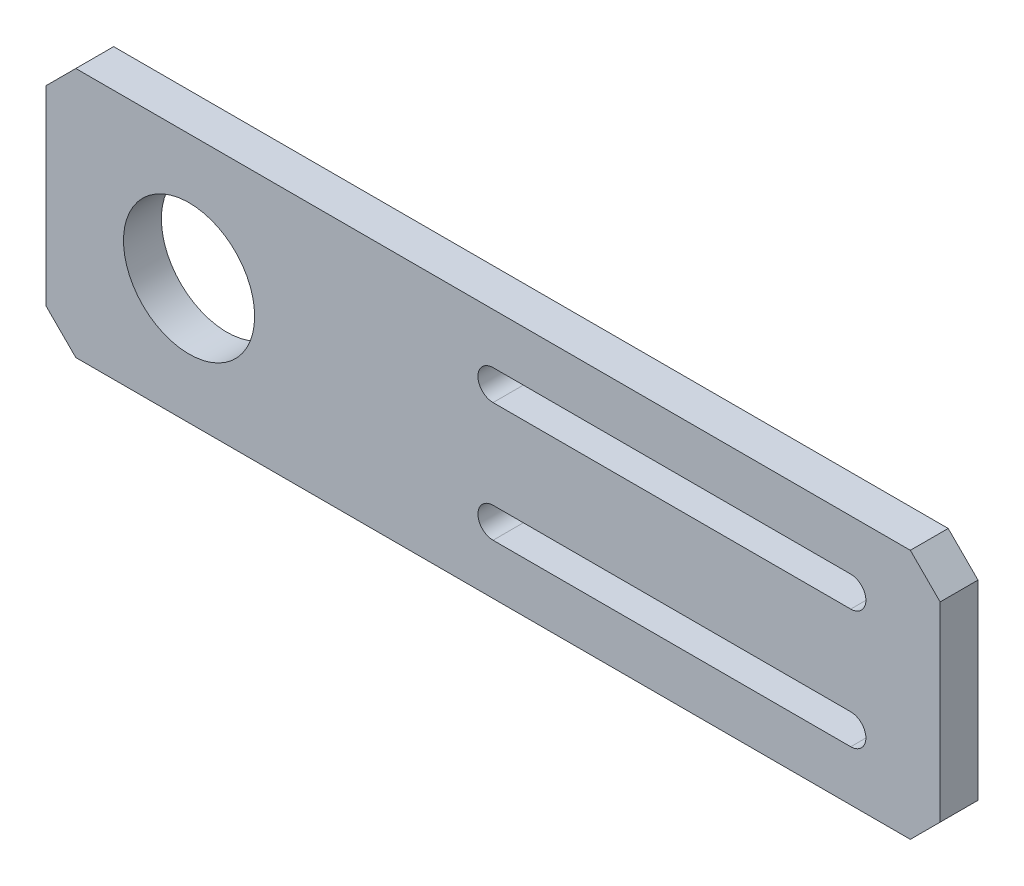
ISO-10303-21;
HEADER;
FILE_DESCRIPTION(('STEP AP214'),'2;1');
FILE_NAME('part.step','',(''),(''),'','','');
FILE_SCHEMA(('AUTOMOTIVE_DESIGN { 1 0 10303 214 1 1 1 1 }'));
ENDSEC;
DATA;
#1=APPLICATION_CONTEXT('core data for automotive mechanical design processes');
#2=APPLICATION_PROTOCOL_DEFINITION('international standard','automotive_design',2000,#1);
#3=PRODUCT_CONTEXT('',#1,'mechanical');
#4=PRODUCT('Part','Part','',(#3));
#5=PRODUCT_RELATED_PRODUCT_CATEGORY('part','',(#4));
#6=PRODUCT_DEFINITION_FORMATION('','',#4);
#7=PRODUCT_DEFINITION_CONTEXT('part definition',#1,'design');
#8=PRODUCT_DEFINITION('design','',#6,#7);
#9=PRODUCT_DEFINITION_SHAPE('','',#8);
#10=(LENGTH_UNIT() NAMED_UNIT(*) SI_UNIT(.MILLI.,.METRE.));
#11=(NAMED_UNIT(*) PLANE_ANGLE_UNIT() SI_UNIT($,.RADIAN.));
#12=(NAMED_UNIT(*) SI_UNIT($,.STERADIAN.) SOLID_ANGLE_UNIT());
#13=UNCERTAINTY_MEASURE_WITH_UNIT(LENGTH_MEASURE(1.E-05),#10,'distance_accuracy_value','');
#14=(GEOMETRIC_REPRESENTATION_CONTEXT(3) GLOBAL_UNCERTAINTY_ASSIGNED_CONTEXT((#13)) GLOBAL_UNIT_ASSIGNED_CONTEXT((#10,
#11,#12)) REPRESENTATION_CONTEXT('',''));
#15=CARTESIAN_POINT('',(0.,0.,0.));
#16=DIRECTION('',(0.,0.,1.));
#17=DIRECTION('',(1.,0.,0.));
#18=AXIS2_PLACEMENT_3D('',#15,#16,#17);
#19=CARTESIAN_POINT('',(0.,0.,6.35));
#20=DIRECTION('',(0.,0.,1.));
#21=DIRECTION('',(1.,0.,0.));
#22=AXIS2_PLACEMENT_3D('',#19,#20,#21);
#23=PLANE('',#22);
#24=DIRECTION('',(0.707106781186547,-0.707106781186548,0.));
#25=VECTOR('',#24,1.);
#26=CARTESIAN_POINT('',(31.75,31.75,6.35));
#27=LINE('',#26,#25);
#28=CARTESIAN_POINT('',(42.5,21.,6.35));
#29=VERTEX_POINT('',#28);
#30=CARTESIAN_POINT('',(47.5,16.,6.35));
#31=VERTEX_POINT('',#30);
#32=EDGE_CURVE('E158',#29,#31,#27,.T.);
#33=ORIENTED_EDGE('',*,*,#32,.F.);
#34=DIRECTION('',(-1.,0.,0.));
#35=VECTOR('',#34,1.);
#36=CARTESIAN_POINT('',(-102.5,21.,6.35));
#37=LINE('',#36,#35);
#38=CARTESIAN_POINT('',(-97.5,21.,6.35));
#39=VERTEX_POINT('',#38);
#40=EDGE_CURVE('E223',#29,#39,#37,.T.);
#41=ORIENTED_EDGE('',*,*,#40,.T.);
#42=DIRECTION('',(0.707106781186548,0.707106781186548,0.));
#43=VECTOR('',#42,1.);
#44=CARTESIAN_POINT('',(-59.25,59.25,6.35));
#45=LINE('',#44,#43);
#46=CARTESIAN_POINT('',(-102.5,16.,6.35));
#47=VERTEX_POINT('',#46);
#48=EDGE_CURVE('E251',#39,#47,#45,.F.);
#49=ORIENTED_EDGE('',*,*,#48,.T.);
#50=DIRECTION('',(0.,-1.,0.));
#51=VECTOR('',#50,1.);
#52=CARTESIAN_POINT('',(-102.5,21.,6.35));
#53=LINE('',#52,#51);
#54=CARTESIAN_POINT('',(-102.5,-16.,6.35));
#55=VERTEX_POINT('',#54);
#56=EDGE_CURVE('E225',#47,#55,#53,.T.);
#57=ORIENTED_EDGE('',*,*,#56,.T.);
#58=DIRECTION('',(-0.707106781186548,0.707106781186548,0.));
#59=VECTOR('',#58,1.);
#60=CARTESIAN_POINT('',(-59.25,-59.25,6.35));
#61=LINE('',#60,#59);
#62=CARTESIAN_POINT('',(-97.5,-21.,6.35));
#63=VERTEX_POINT('',#62);
#64=EDGE_CURVE('E249',#55,#63,#61,.F.);
#65=ORIENTED_EDGE('',*,*,#64,.T.);
#66=DIRECTION('',(1.,0.,0.));
#67=VECTOR('',#66,1.);
#68=CARTESIAN_POINT('',(-102.5,-21.,6.35));
#69=LINE('',#68,#67);
#70=CARTESIAN_POINT('',(42.5,-21.,6.35));
#71=VERTEX_POINT('',#70);
#72=EDGE_CURVE('E173',#63,#71,#69,.T.);
#73=ORIENTED_EDGE('',*,*,#72,.T.);
#74=DIRECTION('',(-0.707106781186547,-0.707106781186548,0.));
#75=VECTOR('',#74,1.);
#76=CARTESIAN_POINT('',(31.75,-31.75,6.35));
#77=LINE('',#76,#75);
#78=CARTESIAN_POINT('',(47.5,-16.,6.35));
#79=VERTEX_POINT('',#78);
#80=EDGE_CURVE('E151',#79,#71,#77,.T.);
#81=ORIENTED_EDGE('',*,*,#80,.F.);
#82=DIRECTION('',(0.,-1.,0.));
#83=VECTOR('',#82,1.);
#84=CARTESIAN_POINT('',(47.5,0.,6.35));
#85=LINE('',#84,#83);
#86=EDGE_CURVE('E161',#31,#79,#85,.T.);
#87=ORIENTED_EDGE('',*,*,#86,.F.);
#88=EDGE_LOOP('',(#33,#41,#49,#57,#65,#73,#81,#87));
#89=FACE_BOUND('',#88,.T.);
#90=DIRECTION('',(1.,0.,0.));
#91=VECTOR('',#90,1.);
#92=CARTESIAN_POINT('',(0.,7.46,6.35));
#93=LINE('',#92,#91);
#94=CARTESIAN_POINT('',(-27.5,7.46,6.35));
#95=VERTEX_POINT('',#94);
#96=CARTESIAN_POINT('',(32.5,7.46,6.35));
#97=VERTEX_POINT('',#96);
#98=EDGE_CURVE('E48',#95,#97,#93,.T.);
#99=ORIENTED_EDGE('',*,*,#98,.F.);
#100=CARTESIAN_POINT('',(-27.5,10.,6.35));
#101=DIRECTION('',(0.,0.,1.));
#102=DIRECTION('',(1.,0.,0.));
#103=AXIS2_PLACEMENT_3D('',#100,#101,#102);
#104=CIRCLE('',#103,2.54);
#105=CARTESIAN_POINT('',(-27.5,12.54,6.35));
#106=VERTEX_POINT('',#105);
#107=EDGE_CURVE('E190',#106,#95,#104,.T.);
#108=ORIENTED_EDGE('',*,*,#107,.F.);
#109=DIRECTION('',(1.,0.,0.));
#110=VECTOR('',#109,1.);
#111=CARTESIAN_POINT('',(0.,12.54,6.35));
#112=LINE('',#111,#110);
#113=CARTESIAN_POINT('',(32.5,12.54,6.35));
#114=VERTEX_POINT('',#113);
#115=EDGE_CURVE('E187',#106,#114,#112,.T.);
#116=ORIENTED_EDGE('',*,*,#115,.T.);
#117=CARTESIAN_POINT('',(32.5,10.,6.35));
#118=DIRECTION('',(0.,0.,1.));
#119=DIRECTION('',(1.,0.,0.));
#120=AXIS2_PLACEMENT_3D('',#117,#118,#119);
#121=CIRCLE('',#120,2.54);
#122=EDGE_CURVE('E183',#97,#114,#121,.T.);
#123=ORIENTED_EDGE('',*,*,#122,.F.);
#124=EDGE_LOOP('',(#99,#108,#116,#123));
#125=FACE_BOUND('',#124,.T.);
#126=CARTESIAN_POINT('',(-78.5,0.,6.35));
#127=DIRECTION('',(0.,0.,1.));
#128=DIRECTION('',(1.,0.,0.));
#129=AXIS2_PLACEMENT_3D('',#126,#127,#128);
#130=CIRCLE('',#129,11.);
#131=CARTESIAN_POINT('',(-67.5,0.,6.35));
#132=VERTEX_POINT('',#131);
#133=EDGE_CURVE('E178',#132,#132,#130,.T.);
#134=ORIENTED_EDGE('',*,*,#133,.F.);
#135=EDGE_LOOP('',(#134));
#136=FACE_BOUND('',#135,.T.);
#137=DIRECTION('',(1.,0.,0.));
#138=VECTOR('',#137,1.);
#139=CARTESIAN_POINT('',(0.,-7.46,6.35));
#140=LINE('',#139,#138);
#141=CARTESIAN_POINT('',(-27.5,-7.46,6.35));
#142=VERTEX_POINT('',#141);
#143=CARTESIAN_POINT('',(32.5,-7.46,6.35));
#144=VERTEX_POINT('',#143);
#145=EDGE_CURVE('E201',#142,#144,#140,.T.);
#146=ORIENTED_EDGE('',*,*,#145,.T.);
#147=CARTESIAN_POINT('',(32.5,-10.,6.35));
#148=DIRECTION('',(0.,0.,1.));
#149=DIRECTION('',(1.,0.,0.));
#150=AXIS2_PLACEMENT_3D('',#147,#148,#149);
#151=CIRCLE('',#150,2.54);
#152=CARTESIAN_POINT('',(32.5,-12.54,6.35));
#153=VERTEX_POINT('',#152);
#154=EDGE_CURVE('E56',#144,#153,#151,.F.);
#155=ORIENTED_EDGE('',*,*,#154,.T.);
#156=DIRECTION('',(1.,0.,0.));
#157=VECTOR('',#156,1.);
#158=CARTESIAN_POINT('',(0.,-12.54,6.35));
#159=LINE('',#158,#157);
#160=CARTESIAN_POINT('',(-27.5,-12.54,6.35));
#161=VERTEX_POINT('',#160);
#162=EDGE_CURVE('E207',#161,#153,#159,.T.);
#163=ORIENTED_EDGE('',*,*,#162,.F.);
#164=CARTESIAN_POINT('',(-27.5,-10.,6.35));
#165=DIRECTION('',(0.,0.,1.));
#166=DIRECTION('',(1.,0.,0.));
#167=AXIS2_PLACEMENT_3D('',#164,#165,#166);
#168=CIRCLE('',#167,2.54);
#169=EDGE_CURVE('E204',#161,#142,#168,.F.);
#170=ORIENTED_EDGE('',*,*,#169,.T.);
#171=EDGE_LOOP('',(#146,#155,#163,#170));
#172=FACE_BOUND('',#171,.T.);
#173=ADVANCED_FACE('F33',(#89,#125,#136,#172),#23,.T.);
#174=CARTESIAN_POINT('',(0.,0.,0.));
#175=DIRECTION('',(0.,0.,1.));
#176=DIRECTION('',(1.,0.,0.));
#177=AXIS2_PLACEMENT_3D('',#174,#175,#176);
#178=PLANE('',#177);
#179=CARTESIAN_POINT('',(-27.5,10.,0.));
#180=DIRECTION('',(0.,0.,1.));
#181=DIRECTION('',(1.,0.,0.));
#182=AXIS2_PLACEMENT_3D('',#179,#180,#181);
#183=CIRCLE('',#182,2.54);
#184=CARTESIAN_POINT('',(-27.5,12.54,0.));
#185=VERTEX_POINT('',#184);
#186=CARTESIAN_POINT('',(-27.5,7.46,0.));
#187=VERTEX_POINT('',#186);
#188=EDGE_CURVE('E272',#185,#187,#183,.T.);
#189=ORIENTED_EDGE('',*,*,#188,.T.);
#190=DIRECTION('',(1.,0.,0.));
#191=VECTOR('',#190,1.);
#192=CARTESIAN_POINT('',(0.,7.46,0.));
#193=LINE('',#192,#191);
#194=CARTESIAN_POINT('',(32.5,7.46,0.));
#195=VERTEX_POINT('',#194);
#196=EDGE_CURVE('E275',#187,#195,#193,.T.);
#197=ORIENTED_EDGE('',*,*,#196,.T.);
#198=CARTESIAN_POINT('',(32.5,10.,0.));
#199=DIRECTION('',(0.,0.,1.));
#200=DIRECTION('',(1.,0.,0.));
#201=AXIS2_PLACEMENT_3D('',#198,#199,#200);
#202=CIRCLE('',#201,2.54);
#203=CARTESIAN_POINT('',(32.5,12.54,0.));
#204=VERTEX_POINT('',#203);
#205=EDGE_CURVE('E266',#195,#204,#202,.T.);
#206=ORIENTED_EDGE('',*,*,#205,.T.);
#207=DIRECTION('',(1.,0.,0.));
#208=VECTOR('',#207,1.);
#209=CARTESIAN_POINT('',(0.,12.54,0.));
#210=LINE('',#209,#208);
#211=EDGE_CURVE('E269',#185,#204,#210,.T.);
#212=ORIENTED_EDGE('',*,*,#211,.F.);
#213=EDGE_LOOP('',(#189,#197,#206,#212));
#214=FACE_BOUND('',#213,.T.);
#215=DIRECTION('',(-1.,0.,0.));
#216=VECTOR('',#215,1.);
#217=CARTESIAN_POINT('',(-102.5,21.,0.));
#218=LINE('',#217,#216);
#219=CARTESIAN_POINT('',(42.5,21.,0.));
#220=VERTEX_POINT('',#219);
#221=CARTESIAN_POINT('',(-97.5,21.,0.));
#222=VERTEX_POINT('',#221);
#223=EDGE_CURVE('E220',#220,#222,#218,.T.);
#224=ORIENTED_EDGE('',*,*,#223,.F.);
#225=DIRECTION('',(0.707106781186547,-0.707106781186548,0.));
#226=VECTOR('',#225,1.);
#227=CARTESIAN_POINT('',(31.75,31.75,0.));
#228=LINE('',#227,#226);
#229=CARTESIAN_POINT('',(47.5,16.,0.));
#230=VERTEX_POINT('',#229);
#231=EDGE_CURVE('E11',#220,#230,#228,.T.);
#232=ORIENTED_EDGE('',*,*,#231,.T.);
#233=DIRECTION('',(0.,-1.,0.));
#234=VECTOR('',#233,1.);
#235=CARTESIAN_POINT('',(47.5,0.,0.));
#236=LINE('',#235,#234);
#237=CARTESIAN_POINT('',(47.5,-16.,0.));
#238=VERTEX_POINT('',#237);
#239=EDGE_CURVE('E41',#230,#238,#236,.T.);
#240=ORIENTED_EDGE('',*,*,#239,.T.);
#241=DIRECTION('',(-0.707106781186547,-0.707106781186548,0.));
#242=VECTOR('',#241,1.);
#243=CARTESIAN_POINT('',(31.75,-31.75,0.));
#244=LINE('',#243,#242);
#245=CARTESIAN_POINT('',(42.5,-21.,0.));
#246=VERTEX_POINT('',#245);
#247=EDGE_CURVE('E154',#238,#246,#244,.T.);
#248=ORIENTED_EDGE('',*,*,#247,.T.);
#249=DIRECTION('',(1.,0.,0.));
#250=VECTOR('',#249,1.);
#251=CARTESIAN_POINT('',(-102.5,-21.,0.));
#252=LINE('',#251,#250);
#253=CARTESIAN_POINT('',(-97.5,-21.,0.));
#254=VERTEX_POINT('',#253);
#255=EDGE_CURVE('E226',#254,#246,#252,.T.);
#256=ORIENTED_EDGE('',*,*,#255,.F.);
#257=DIRECTION('',(0.707106781186548,-0.707106781186548,0.));
#258=VECTOR('',#257,1.);
#259=CARTESIAN_POINT('',(-97.5,-21.,0.));
#260=LINE('',#259,#258);
#261=CARTESIAN_POINT('',(-102.5,-16.,0.));
#262=VERTEX_POINT('',#261);
#263=EDGE_CURVE('E241',#254,#262,#260,.F.);
#264=ORIENTED_EDGE('',*,*,#263,.T.);
#265=DIRECTION('',(0.,-1.,0.));
#266=VECTOR('',#265,1.);
#267=CARTESIAN_POINT('',(-102.5,21.,0.));
#268=LINE('',#267,#266);
#269=CARTESIAN_POINT('',(-102.5,16.,0.));
#270=VERTEX_POINT('',#269);
#271=EDGE_CURVE('E232',#270,#262,#268,.T.);
#272=ORIENTED_EDGE('',*,*,#271,.F.);
#273=DIRECTION('',(-0.707106781186548,-0.707106781186548,0.));
#274=VECTOR('',#273,1.);
#275=CARTESIAN_POINT('',(-102.5,16.,0.));
#276=LINE('',#275,#274);
#277=EDGE_CURVE('E243',#270,#222,#276,.F.);
#278=ORIENTED_EDGE('',*,*,#277,.T.);
#279=EDGE_LOOP('',(#224,#232,#240,#248,#256,#264,#272,#278));
#280=FACE_BOUND('',#279,.T.);
#281=CARTESIAN_POINT('',(-78.5,0.,0.));
#282=DIRECTION('',(0.,0.,1.));
#283=DIRECTION('',(1.,0.,0.));
#284=AXIS2_PLACEMENT_3D('',#281,#282,#283);
#285=CIRCLE('',#284,11.);
#286=CARTESIAN_POINT('',(-67.5,0.,0.));
#287=VERTEX_POINT('',#286);
#288=EDGE_CURVE('E217',#287,#287,#285,.T.);
#289=ORIENTED_EDGE('',*,*,#288,.T.);
#290=EDGE_LOOP('',(#289));
#291=FACE_BOUND('',#290,.T.);
#292=CARTESIAN_POINT('',(32.5,-10.,0.));
#293=DIRECTION('',(0.,0.,1.));
#294=DIRECTION('',(1.,0.,0.));
#295=AXIS2_PLACEMENT_3D('',#292,#293,#294);
#296=CIRCLE('',#295,2.54);
#297=CARTESIAN_POINT('',(32.5,-7.46,0.));
#298=VERTEX_POINT('',#297);
#299=CARTESIAN_POINT('',(32.5,-12.54,0.));
#300=VERTEX_POINT('',#299);
#301=EDGE_CURVE('E264',#298,#300,#296,.F.);
#302=ORIENTED_EDGE('',*,*,#301,.F.);
#303=DIRECTION('',(1.,0.,0.));
#304=VECTOR('',#303,1.);
#305=CARTESIAN_POINT('',(0.,-7.46,0.));
#306=LINE('',#305,#304);
#307=CARTESIAN_POINT('',(-27.5,-7.46,0.));
#308=VERTEX_POINT('',#307);
#309=EDGE_CURVE('E256',#308,#298,#306,.T.);
#310=ORIENTED_EDGE('',*,*,#309,.F.);
#311=CARTESIAN_POINT('',(-27.5,-10.,0.));
#312=DIRECTION('',(0.,0.,1.));
#313=DIRECTION('',(1.,0.,0.));
#314=AXIS2_PLACEMENT_3D('',#311,#312,#313);
#315=CIRCLE('',#314,2.54);
#316=CARTESIAN_POINT('',(-27.5,-12.54,0.));
#317=VERTEX_POINT('',#316);
#318=EDGE_CURVE('E258',#317,#308,#315,.F.);
#319=ORIENTED_EDGE('',*,*,#318,.F.);
#320=DIRECTION('',(1.,0.,0.));
#321=VECTOR('',#320,1.);
#322=CARTESIAN_POINT('',(0.,-12.54,0.));
#323=LINE('',#322,#321);
#324=EDGE_CURVE('E261',#317,#300,#323,.T.);
#325=ORIENTED_EDGE('',*,*,#324,.T.);
#326=EDGE_LOOP('',(#302,#310,#319,#325));
#327=FACE_BOUND('',#326,.T.);
#328=ADVANCED_FACE('F280',(#214,#280,#291,#327),#178,.F.);
#329=CARTESIAN_POINT('',(-102.5,21.,6.35));
#330=DIRECTION('',(0.,-1.,0.));
#331=DIRECTION('',(0.,0.,-1.));
#332=AXIS2_PLACEMENT_3D('',#329,#330,#331);
#333=PLANE('',#332);
#334=ORIENTED_EDGE('',*,*,#40,.F.);
#335=DIRECTION('',(0.,0.,1.));
#336=VECTOR('',#335,1.);
#337=CARTESIAN_POINT('',(42.5,21.,-3.65));
#338=LINE('',#337,#336);
#339=EDGE_CURVE('E179',#220,#29,#338,.T.);
#340=ORIENTED_EDGE('',*,*,#339,.F.);
#341=ORIENTED_EDGE('',*,*,#223,.T.);
#342=DIRECTION('',(0.,0.,1.));
#343=VECTOR('',#342,1.);
#344=CARTESIAN_POINT('',(-97.5,21.,6.35));
#345=LINE('',#344,#343);
#346=EDGE_CURVE('E246',#222,#39,#345,.T.);
#347=ORIENTED_EDGE('',*,*,#346,.T.);
#348=EDGE_LOOP('',(#334,#340,#341,#347));
#349=FACE_BOUND('',#348,.T.);
#350=ADVANCED_FACE('F288',(#349),#333,.F.);
#351=CARTESIAN_POINT('',(-102.5,21.,6.35));
#352=DIRECTION('',(1.,0.,0.));
#353=DIRECTION('',(0.,0.,-1.));
#354=AXIS2_PLACEMENT_3D('',#351,#352,#353);
#355=PLANE('',#354);
#356=ORIENTED_EDGE('',*,*,#56,.F.);
#357=DIRECTION('',(0.,0.,-1.));
#358=VECTOR('',#357,1.);
#359=CARTESIAN_POINT('',(-102.5,16.,6.35));
#360=LINE('',#359,#358);
#361=EDGE_CURVE('E238',#47,#270,#360,.T.);
#362=ORIENTED_EDGE('',*,*,#361,.T.);
#363=ORIENTED_EDGE('',*,*,#271,.T.);
#364=DIRECTION('',(0.,0.,1.));
#365=VECTOR('',#364,1.);
#366=CARTESIAN_POINT('',(-102.5,-16.0000000000001,6.35));
#367=LINE('',#366,#365);
#368=EDGE_CURVE('E230',#262,#55,#367,.T.);
#369=ORIENTED_EDGE('',*,*,#368,.T.);
#370=EDGE_LOOP('',(#356,#362,#363,#369));
#371=FACE_BOUND('',#370,.T.);
#372=ADVANCED_FACE('F297',(#371),#355,.F.);
#373=CARTESIAN_POINT('',(-102.5,-21.,6.35));
#374=DIRECTION('',(0.,1.,0.));
#375=DIRECTION('',(0.,0.,1.));
#376=AXIS2_PLACEMENT_3D('',#373,#374,#375);
#377=PLANE('',#376);
#378=ORIENTED_EDGE('',*,*,#255,.T.);
#379=DIRECTION('',(0.,0.,1.));
#380=VECTOR('',#379,1.);
#381=CARTESIAN_POINT('',(42.5,-21.,-3.65));
#382=LINE('',#381,#380);
#383=EDGE_CURVE('E157',#246,#71,#382,.T.);
#384=ORIENTED_EDGE('',*,*,#383,.T.);
#385=ORIENTED_EDGE('',*,*,#72,.F.);
#386=DIRECTION('',(0.,0.,-1.));
#387=VECTOR('',#386,1.);
#388=CARTESIAN_POINT('',(-97.5,-21.,6.35));
#389=LINE('',#388,#387);
#390=EDGE_CURVE('E253',#63,#254,#389,.T.);
#391=ORIENTED_EDGE('',*,*,#390,.T.);
#392=EDGE_LOOP('',(#378,#384,#385,#391));
#393=FACE_BOUND('',#392,.T.);
#394=ADVANCED_FACE('F303',(#393),#377,.F.);
#395=CARTESIAN_POINT('',(-78.5,0.,0.));
#396=DIRECTION('',(0.,0.,1.));
#397=DIRECTION('',(1.,0.,0.));
#398=AXIS2_PLACEMENT_3D('',#395,#396,#397);
#399=CYLINDRICAL_SURFACE('',#398,11.);
#400=ORIENTED_EDGE('',*,*,#288,.F.);
#401=EDGE_LOOP('',(#400));
#402=FACE_BOUND('',#401,.T.);
#403=ORIENTED_EDGE('',*,*,#133,.T.);
#404=EDGE_LOOP('',(#403));
#405=FACE_BOUND('',#404,.T.);
#406=ADVANCED_FACE('F305',(#402,#405),#399,.F.);
#407=CARTESIAN_POINT('',(-102.5,16.,6.35));
#408=DIRECTION('',(0.707106781186547,-0.707106781186547,0.));
#409=DIRECTION('',(0.,0.,-1.));
#410=AXIS2_PLACEMENT_3D('',#407,#408,#409);
#411=PLANE('',#410);
#412=ORIENTED_EDGE('',*,*,#48,.F.);
#413=ORIENTED_EDGE('',*,*,#346,.F.);
#414=ORIENTED_EDGE('',*,*,#277,.F.);
#415=ORIENTED_EDGE('',*,*,#361,.F.);
#416=EDGE_LOOP('',(#412,#413,#414,#415));
#417=FACE_BOUND('',#416,.T.);
#418=ADVANCED_FACE('F293',(#417),#411,.F.);
#419=CARTESIAN_POINT('',(-97.5,-21.,6.35));
#420=DIRECTION('',(0.707106781186547,0.707106781186547,0.));
#421=DIRECTION('',(0.,0.,-1.));
#422=AXIS2_PLACEMENT_3D('',#419,#420,#421);
#423=PLANE('',#422);
#424=ORIENTED_EDGE('',*,*,#64,.F.);
#425=ORIENTED_EDGE('',*,*,#368,.F.);
#426=ORIENTED_EDGE('',*,*,#263,.F.);
#427=ORIENTED_EDGE('',*,*,#390,.F.);
#428=EDGE_LOOP('',(#424,#425,#426,#427));
#429=FACE_BOUND('',#428,.T.);
#430=ADVANCED_FACE('F35',(#429),#423,.F.);
#431=CARTESIAN_POINT('',(32.5,-10.,-3.65));
#432=DIRECTION('',(0.,0.,1.));
#433=DIRECTION('',(1.,0.,0.));
#434=AXIS2_PLACEMENT_3D('',#431,#432,#433);
#435=CYLINDRICAL_SURFACE('',#434,2.54);
#436=ORIENTED_EDGE('',*,*,#301,.T.);
#437=DIRECTION('',(0.,0.,1.));
#438=VECTOR('',#437,1.);
#439=CARTESIAN_POINT('',(32.5,-12.54,-3.65));
#440=LINE('',#439,#438);
#441=EDGE_CURVE('E184',#300,#153,#440,.T.);
#442=ORIENTED_EDGE('',*,*,#441,.T.);
#443=ORIENTED_EDGE('',*,*,#154,.F.);
#444=DIRECTION('',(0.,0.,1.));
#445=VECTOR('',#444,1.);
#446=CARTESIAN_POINT('',(32.5,-7.46,-3.65));
#447=LINE('',#446,#445);
#448=EDGE_CURVE('E210',#298,#144,#447,.T.);
#449=ORIENTED_EDGE('',*,*,#448,.F.);
#450=EDGE_LOOP('',(#436,#442,#443,#449));
#451=FACE_BOUND('',#450,.T.);
#452=ADVANCED_FACE('F322',(#451),#435,.F.);
#453=CARTESIAN_POINT('',(0.,-12.54,-3.65));
#454=DIRECTION('',(0.,-1.,0.));
#455=DIRECTION('',(1.,0.,0.));
#456=AXIS2_PLACEMENT_3D('',#453,#454,#455);
#457=PLANE('',#456);
#458=DIRECTION('',(0.,0.,1.));
#459=VECTOR('',#458,1.);
#460=CARTESIAN_POINT('',(-27.5,-12.54,-3.65));
#461=LINE('',#460,#459);
#462=EDGE_CURVE('E212',#317,#161,#461,.T.);
#463=ORIENTED_EDGE('',*,*,#462,.T.);
#464=ORIENTED_EDGE('',*,*,#162,.T.);
#465=ORIENTED_EDGE('',*,*,#441,.F.);
#466=ORIENTED_EDGE('',*,*,#324,.F.);
#467=EDGE_LOOP('',(#463,#464,#465,#466));
#468=FACE_BOUND('',#467,.T.);
#469=ADVANCED_FACE('F325',(#468),#457,.F.);
#470=CARTESIAN_POINT('',(-27.5,-10.,-3.65));
#471=DIRECTION('',(0.,0.,1.));
#472=DIRECTION('',(1.,0.,0.));
#473=AXIS2_PLACEMENT_3D('',#470,#471,#472);
#474=CYLINDRICAL_SURFACE('',#473,2.54);
#475=ORIENTED_EDGE('',*,*,#318,.T.);
#476=DIRECTION('',(0.,0.,1.));
#477=VECTOR('',#476,1.);
#478=CARTESIAN_POINT('',(-27.5,-7.46,-3.65));
#479=LINE('',#478,#477);
#480=EDGE_CURVE('E214',#308,#142,#479,.T.);
#481=ORIENTED_EDGE('',*,*,#480,.T.);
#482=ORIENTED_EDGE('',*,*,#169,.F.);
#483=ORIENTED_EDGE('',*,*,#462,.F.);
#484=EDGE_LOOP('',(#475,#481,#482,#483));
#485=FACE_BOUND('',#484,.T.);
#486=ADVANCED_FACE('F330',(#485),#474,.F.);
#487=CARTESIAN_POINT('',(0.,-7.46,-3.65));
#488=DIRECTION('',(0.,-1.,0.));
#489=DIRECTION('',(1.,0.,0.));
#490=AXIS2_PLACEMENT_3D('',#487,#488,#489);
#491=PLANE('',#490);
#492=ORIENTED_EDGE('',*,*,#309,.T.);
#493=ORIENTED_EDGE('',*,*,#448,.T.);
#494=ORIENTED_EDGE('',*,*,#145,.F.);
#495=ORIENTED_EDGE('',*,*,#480,.F.);
#496=EDGE_LOOP('',(#492,#493,#494,#495));
#497=FACE_BOUND('',#496,.T.);
#498=ADVANCED_FACE('F326',(#497),#491,.T.);
#499=CARTESIAN_POINT('',(0.,7.46,-3.65));
#500=DIRECTION('',(0.,-1.,0.));
#501=DIRECTION('',(1.,0.,0.));
#502=AXIS2_PLACEMENT_3D('',#499,#500,#501);
#503=PLANE('',#502);
#504=DIRECTION('',(0.,0.,1.));
#505=VECTOR('',#504,1.);
#506=CARTESIAN_POINT('',(-27.5,7.46,-3.65));
#507=LINE('',#506,#505);
#508=EDGE_CURVE('E168',#187,#95,#507,.T.);
#509=ORIENTED_EDGE('',*,*,#508,.T.);
#510=ORIENTED_EDGE('',*,*,#98,.T.);
#511=DIRECTION('',(0.,0.,1.));
#512=VECTOR('',#511,1.);
#513=CARTESIAN_POINT('',(32.5,7.46,-3.65));
#514=LINE('',#513,#512);
#515=EDGE_CURVE('E193',#195,#97,#514,.T.);
#516=ORIENTED_EDGE('',*,*,#515,.F.);
#517=ORIENTED_EDGE('',*,*,#196,.F.);
#518=EDGE_LOOP('',(#509,#510,#516,#517));
#519=FACE_BOUND('',#518,.T.);
#520=ADVANCED_FACE('F329',(#519),#503,.F.);
#521=CARTESIAN_POINT('',(-27.5,10.,-3.65));
#522=DIRECTION('',(0.,0.,1.));
#523=DIRECTION('',(1.,0.,0.));
#524=AXIS2_PLACEMENT_3D('',#521,#522,#523);
#525=CYLINDRICAL_SURFACE('',#524,2.54);
#526=DIRECTION('',(0.,0.,1.));
#527=VECTOR('',#526,1.);
#528=CARTESIAN_POINT('',(-27.5,12.54,-3.65));
#529=LINE('',#528,#527);
#530=EDGE_CURVE('E195',#185,#106,#529,.T.);
#531=ORIENTED_EDGE('',*,*,#530,.T.);
#532=ORIENTED_EDGE('',*,*,#107,.T.);
#533=ORIENTED_EDGE('',*,*,#508,.F.);
#534=ORIENTED_EDGE('',*,*,#188,.F.);
#535=EDGE_LOOP('',(#531,#532,#533,#534));
#536=FACE_BOUND('',#535,.T.);
#537=ADVANCED_FACE('F340',(#536),#525,.F.);
#538=CARTESIAN_POINT('',(0.,12.54,-3.65));
#539=DIRECTION('',(0.,-1.,0.));
#540=DIRECTION('',(1.,0.,0.));
#541=AXIS2_PLACEMENT_3D('',#538,#539,#540);
#542=PLANE('',#541);
#543=ORIENTED_EDGE('',*,*,#211,.T.);
#544=DIRECTION('',(0.,0.,1.));
#545=VECTOR('',#544,1.);
#546=CARTESIAN_POINT('',(32.5,12.54,-3.65));
#547=LINE('',#546,#545);
#548=EDGE_CURVE('E197',#204,#114,#547,.T.);
#549=ORIENTED_EDGE('',*,*,#548,.T.);
#550=ORIENTED_EDGE('',*,*,#115,.F.);
#551=ORIENTED_EDGE('',*,*,#530,.F.);
#552=EDGE_LOOP('',(#543,#549,#550,#551));
#553=FACE_BOUND('',#552,.T.);
#554=ADVANCED_FACE('F344',(#553),#542,.T.);
#555=CARTESIAN_POINT('',(32.5,10.,-3.65));
#556=DIRECTION('',(0.,0.,1.));
#557=DIRECTION('',(1.,0.,0.));
#558=AXIS2_PLACEMENT_3D('',#555,#556,#557);
#559=CYLINDRICAL_SURFACE('',#558,2.54);
#560=ORIENTED_EDGE('',*,*,#515,.T.);
#561=ORIENTED_EDGE('',*,*,#122,.T.);
#562=ORIENTED_EDGE('',*,*,#548,.F.);
#563=ORIENTED_EDGE('',*,*,#205,.F.);
#564=EDGE_LOOP('',(#560,#561,#562,#563));
#565=FACE_BOUND('',#564,.T.);
#566=ADVANCED_FACE('F341',(#565),#559,.F.);
#567=CARTESIAN_POINT('',(47.5,0.,-3.65));
#568=DIRECTION('',(-1.,0.,0.));
#569=DIRECTION('',(0.,0.,1.));
#570=AXIS2_PLACEMENT_3D('',#567,#568,#569);
#571=PLANE('',#570);
#572=DIRECTION('',(0.,0.,1.));
#573=VECTOR('',#572,1.);
#574=CARTESIAN_POINT('',(47.5,16.,-3.65));
#575=LINE('',#574,#573);
#576=EDGE_CURVE('E164',#230,#31,#575,.T.);
#577=ORIENTED_EDGE('',*,*,#576,.T.);
#578=ORIENTED_EDGE('',*,*,#86,.T.);
#579=DIRECTION('',(0.,0.,1.));
#580=VECTOR('',#579,1.);
#581=CARTESIAN_POINT('',(47.5,-16.,-3.65));
#582=LINE('',#581,#580);
#583=EDGE_CURVE('E147',#238,#79,#582,.T.);
#584=ORIENTED_EDGE('',*,*,#583,.F.);
#585=ORIENTED_EDGE('',*,*,#239,.F.);
#586=EDGE_LOOP('',(#577,#578,#584,#585));
#587=FACE_BOUND('',#586,.T.);
#588=ADVANCED_FACE('F162',(#587),#571,.F.);
#589=CARTESIAN_POINT('',(31.75,31.75,-3.65));
#590=DIRECTION('',(-0.707106781186548,-0.707106781186547,0.));
#591=DIRECTION('',(0.707106781186547,-0.707106781186548,0.));
#592=AXIS2_PLACEMENT_3D('',#589,#590,#591);
#593=PLANE('',#592);
#594=ORIENTED_EDGE('',*,*,#339,.T.);
#595=ORIENTED_EDGE('',*,*,#32,.T.);
#596=ORIENTED_EDGE('',*,*,#576,.F.);
#597=ORIENTED_EDGE('',*,*,#231,.F.);
#598=EDGE_LOOP('',(#594,#595,#596,#597));
#599=FACE_BOUND('',#598,.T.);
#600=ADVANCED_FACE('F284',(#599),#593,.F.);
#601=CARTESIAN_POINT('',(31.75,-31.75,-3.65));
#602=DIRECTION('',(-0.707106781186548,0.707106781186547,0.));
#603=DIRECTION('',(-0.707106781186547,-0.707106781186548,0.));
#604=AXIS2_PLACEMENT_3D('',#601,#602,#603);
#605=PLANE('',#604);
#606=ORIENTED_EDGE('',*,*,#583,.T.);
#607=ORIENTED_EDGE('',*,*,#80,.T.);
#608=ORIENTED_EDGE('',*,*,#383,.F.);
#609=ORIENTED_EDGE('',*,*,#247,.F.);
#610=EDGE_LOOP('',(#606,#607,#608,#609));
#611=FACE_BOUND('',#610,.T.);
#612=ADVANCED_FACE('F149',(#611),#605,.F.);
#613=CLOSED_SHELL('',(#173,#328,#350,#372,#394,#406,#418,#430,#452,#469,#486,#498,#520,#537,
#554,#566,#588,#600,#612));
#614=MANIFOLD_SOLID_BREP('B2',#613);
#615=ADVANCED_BREP_SHAPE_REPRESENTATION('',(#18,#614),#14);
#616=SHAPE_DEFINITION_REPRESENTATION(#9,#615);
ENDSEC;
END-ISO-10303-21;
